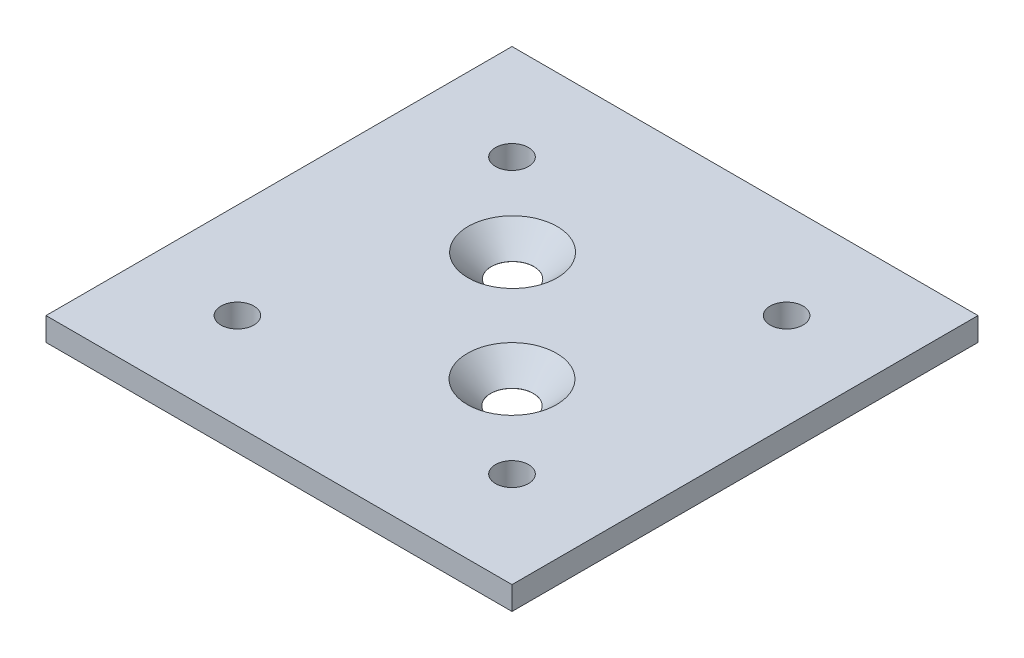
ISO-10303-21;
HEADER;
FILE_DESCRIPTION(('STEP AP214'),'2;1');
FILE_NAME('part.step','',(''),(''),'','','');
FILE_SCHEMA(('AUTOMOTIVE_DESIGN { 1 0 10303 214 1 1 1 1 }'));
ENDSEC;
DATA;
#1=APPLICATION_CONTEXT('core data for automotive mechanical design processes');
#2=APPLICATION_PROTOCOL_DEFINITION('international standard','automotive_design',2000,#1);
#3=PRODUCT_CONTEXT('',#1,'mechanical');
#4=PRODUCT('Part','Part','',(#3));
#5=PRODUCT_RELATED_PRODUCT_CATEGORY('part','',(#4));
#6=PRODUCT_DEFINITION_FORMATION('','',#4);
#7=PRODUCT_DEFINITION_CONTEXT('part definition',#1,'design');
#8=PRODUCT_DEFINITION('design','',#6,#7);
#9=PRODUCT_DEFINITION_SHAPE('','',#8);
#10=(LENGTH_UNIT() NAMED_UNIT(*) SI_UNIT(.MILLI.,.METRE.));
#11=(NAMED_UNIT(*) PLANE_ANGLE_UNIT() SI_UNIT($,.RADIAN.));
#12=(NAMED_UNIT(*) SI_UNIT($,.STERADIAN.) SOLID_ANGLE_UNIT());
#13=UNCERTAINTY_MEASURE_WITH_UNIT(LENGTH_MEASURE(1.E-05),#10,'distance_accuracy_value','');
#14=(GEOMETRIC_REPRESENTATION_CONTEXT(3) GLOBAL_UNCERTAINTY_ASSIGNED_CONTEXT((#13)) GLOBAL_UNIT_ASSIGNED_CONTEXT((#10,
#11,#12)) REPRESENTATION_CONTEXT('',''));
#15=CARTESIAN_POINT('',(0.,0.,0.));
#16=DIRECTION('',(0.,0.,1.));
#17=DIRECTION('',(1.,0.,0.));
#18=AXIS2_PLACEMENT_3D('',#15,#16,#17);
#19=CARTESIAN_POINT('',(0.,3.,0.));
#20=DIRECTION('',(0.,-1.,0.));
#21=DIRECTION('',(0.,0.,-1.));
#22=AXIS2_PLACEMENT_3D('',#19,#20,#21);
#23=PLANE('',#22);
#24=CARTESIAN_POINT('',(22.9663646158878,3.,-37.1083031226422));
#25=DIRECTION('',(0.,1.,0.));
#26=DIRECTION('',(0.,0.,1.));
#27=AXIS2_PLACEMENT_3D('',#24,#25,#26);
#28=CIRCLE('',#27,5.735);
#29=CARTESIAN_POINT('',(22.9663646158878,3.,-31.3733031226422));
#30=VERTEX_POINT('',#29);
#31=EDGE_CURVE('E152',#30,#30,#28,.T.);
#32=ORIENTED_EDGE('',*,*,#31,.F.);
#33=EDGE_LOOP('',(#32));
#34=FACE_BOUND('',#33,.T.);
#35=CARTESIAN_POINT('',(37.0710678118655,3.,-22.9289321881345));
#36=DIRECTION('',(0.,1.,0.));
#37=DIRECTION('',(0.,0.,1.));
#38=AXIS2_PLACEMENT_3D('',#35,#36,#37);
#39=CIRCLE('',#38,5.735);
#40=CARTESIAN_POINT('',(37.0710678118655,3.,-17.1939321881345));
#41=VERTEX_POINT('',#40);
#42=EDGE_CURVE('E143',#41,#41,#39,.T.);
#43=ORIENTED_EDGE('',*,*,#42,.F.);
#44=EDGE_LOOP('',(#43));
#45=FACE_BOUND('',#44,.T.);
#46=CARTESIAN_POINT('',(47.6776695296637,3.,-12.3223304703363));
#47=DIRECTION('',(0.,1.,0.));
#48=DIRECTION('',(0.,0.,1.));
#49=AXIS2_PLACEMENT_3D('',#46,#47,#48);
#50=CIRCLE('',#49,2.125);
#51=CARTESIAN_POINT('',(47.6776695296637,3.,-10.1973304703363));
#52=VERTEX_POINT('',#51);
#53=EDGE_CURVE('E123',#52,#52,#50,.T.);
#54=ORIENTED_EDGE('',*,*,#53,.F.);
#55=EDGE_LOOP('',(#54));
#56=FACE_BOUND('',#55,.T.);
#57=CARTESIAN_POINT('',(12.3223304703363,3.,-47.6776695296637));
#58=DIRECTION('',(0.,1.,0.));
#59=DIRECTION('',(0.,0.,1.));
#60=AXIS2_PLACEMENT_3D('',#57,#58,#59);
#61=CIRCLE('',#60,2.125);
#62=CARTESIAN_POINT('',(12.3223304703363,3.,-45.5526695296637));
#63=VERTEX_POINT('',#62);
#64=EDGE_CURVE('E102',#63,#63,#61,.T.);
#65=ORIENTED_EDGE('',*,*,#64,.F.);
#66=EDGE_LOOP('',(#65));
#67=FACE_BOUND('',#66,.T.);
#68=DIRECTION('',(0.,0.,1.));
#69=VECTOR('',#68,1.);
#70=CARTESIAN_POINT('',(0.,3.,0.));
#71=LINE('',#70,#69);
#72=CARTESIAN_POINT('',(0.,3.,-60.));
#73=VERTEX_POINT('',#72);
#74=CARTESIAN_POINT('',(0.,3.,0.));
#75=VERTEX_POINT('',#74);
#76=EDGE_CURVE('E87',#73,#75,#71,.T.);
#77=ORIENTED_EDGE('',*,*,#76,.T.);
#78=DIRECTION('',(1.,0.,0.));
#79=VECTOR('',#78,1.);
#80=CARTESIAN_POINT('',(0.,3.,0.));
#81=LINE('',#80,#79);
#82=CARTESIAN_POINT('',(60.,3.,0.));
#83=VERTEX_POINT('',#82);
#84=EDGE_CURVE('E82',#75,#83,#81,.T.);
#85=ORIENTED_EDGE('',*,*,#84,.T.);
#86=DIRECTION('',(0.,0.,-1.));
#87=VECTOR('',#86,1.);
#88=CARTESIAN_POINT('',(60.,3.,0.));
#89=LINE('',#88,#87);
#90=CARTESIAN_POINT('',(60.,3.,-60.));
#91=VERTEX_POINT('',#90);
#92=EDGE_CURVE('E85',#83,#91,#89,.T.);
#93=ORIENTED_EDGE('',*,*,#92,.T.);
#94=DIRECTION('',(-1.,0.,0.));
#95=VECTOR('',#94,1.);
#96=CARTESIAN_POINT('',(0.,3.,-60.));
#97=LINE('',#96,#95);
#98=EDGE_CURVE('E52',#91,#73,#97,.T.);
#99=ORIENTED_EDGE('',*,*,#98,.T.);
#100=EDGE_LOOP('',(#77,#85,#93,#99));
#101=FACE_BOUND('',#100,.T.);
#102=CARTESIAN_POINT('',(12.3223304703363,3.,-12.3223304703363));
#103=DIRECTION('',(0.,1.,0.));
#104=DIRECTION('',(0.,0.,1.));
#105=AXIS2_PLACEMENT_3D('',#102,#103,#104);
#106=CIRCLE('',#105,2.125);
#107=CARTESIAN_POINT('',(12.3223304703363,3.,-10.1973304703363));
#108=VERTEX_POINT('',#107);
#109=EDGE_CURVE('E117',#108,#108,#106,.T.);
#110=ORIENTED_EDGE('',*,*,#109,.F.);
#111=EDGE_LOOP('',(#110));
#112=FACE_BOUND('',#111,.T.);
#113=CARTESIAN_POINT('',(47.6776695296637,3.,-47.6776695296637));
#114=DIRECTION('',(0.,1.,0.));
#115=DIRECTION('',(0.,0.,1.));
#116=AXIS2_PLACEMENT_3D('',#113,#114,#115);
#117=CIRCLE('',#116,2.125);
#118=CARTESIAN_POINT('',(47.6776695296637,3.,-45.5526695296637));
#119=VERTEX_POINT('',#118);
#120=EDGE_CURVE('E129',#119,#119,#117,.T.);
#121=ORIENTED_EDGE('',*,*,#120,.F.);
#122=EDGE_LOOP('',(#121));
#123=FACE_BOUND('',#122,.T.);
#124=ADVANCED_FACE('F35',(#34,#45,#56,#67,#101,#112,#123),#23,.F.);
#125=CARTESIAN_POINT('',(0.,0.,0.));
#126=DIRECTION('',(0.,-1.,0.));
#127=DIRECTION('',(0.,0.,-1.));
#128=AXIS2_PLACEMENT_3D('',#125,#126,#127);
#129=PLANE('',#128);
#130=CARTESIAN_POINT('',(22.9663646158878,0.,-37.1083031226422));
#131=DIRECTION('',(0.,1.,0.));
#132=DIRECTION('',(0.,0.,1.));
#133=AXIS2_PLACEMENT_3D('',#130,#131,#132);
#134=CIRCLE('',#133,2.75);
#135=CARTESIAN_POINT('',(22.9663646158878,0.,-34.3583031226422));
#136=VERTEX_POINT('',#135);
#137=EDGE_CURVE('E146',#136,#136,#134,.T.);
#138=ORIENTED_EDGE('',*,*,#137,.T.);
#139=EDGE_LOOP('',(#138));
#140=FACE_BOUND('',#139,.T.);
#141=CARTESIAN_POINT('',(37.0710678118655,0.,-22.9289321881345));
#142=DIRECTION('',(0.,1.,0.));
#143=DIRECTION('',(0.,0.,1.));
#144=AXIS2_PLACEMENT_3D('',#141,#142,#143);
#145=CIRCLE('',#144,2.75);
#146=CARTESIAN_POINT('',(37.0710678118655,0.,-20.1789321881345));
#147=VERTEX_POINT('',#146);
#148=EDGE_CURVE('E135',#147,#147,#145,.T.);
#149=ORIENTED_EDGE('',*,*,#148,.T.);
#150=EDGE_LOOP('',(#149));
#151=FACE_BOUND('',#150,.T.);
#152=CARTESIAN_POINT('',(47.6776695296637,0.,-12.3223304703363));
#153=DIRECTION('',(0.,1.,0.));
#154=DIRECTION('',(0.,0.,1.));
#155=AXIS2_PLACEMENT_3D('',#152,#153,#154);
#156=CIRCLE('',#155,2.125);
#157=CARTESIAN_POINT('',(47.6776695296637,0.,-10.1973304703363));
#158=VERTEX_POINT('',#157);
#159=EDGE_CURVE('E126',#158,#158,#156,.T.);
#160=ORIENTED_EDGE('',*,*,#159,.T.);
#161=EDGE_LOOP('',(#160));
#162=FACE_BOUND('',#161,.T.);
#163=CARTESIAN_POINT('',(12.3223304703363,0.,-47.6776695296637));
#164=DIRECTION('',(0.,1.,0.));
#165=DIRECTION('',(0.,0.,1.));
#166=AXIS2_PLACEMENT_3D('',#163,#164,#165);
#167=CIRCLE('',#166,2.125);
#168=CARTESIAN_POINT('',(12.3223304703363,0.,-45.5526695296637));
#169=VERTEX_POINT('',#168);
#170=EDGE_CURVE('E114',#169,#169,#167,.T.);
#171=ORIENTED_EDGE('',*,*,#170,.T.);
#172=EDGE_LOOP('',(#171));
#173=FACE_BOUND('',#172,.T.);
#174=DIRECTION('',(0.,0.,1.));
#175=VECTOR('',#174,1.);
#176=CARTESIAN_POINT('',(0.,0.,0.));
#177=LINE('',#176,#175);
#178=CARTESIAN_POINT('',(0.,0.,-60.));
#179=VERTEX_POINT('',#178);
#180=CARTESIAN_POINT('',(0.,0.,0.));
#181=VERTEX_POINT('',#180);
#182=EDGE_CURVE('E99',#179,#181,#177,.T.);
#183=ORIENTED_EDGE('',*,*,#182,.F.);
#184=DIRECTION('',(-1.,0.,0.));
#185=VECTOR('',#184,1.);
#186=CARTESIAN_POINT('',(0.,0.,-60.));
#187=LINE('',#186,#185);
#188=CARTESIAN_POINT('',(60.,0.,-60.));
#189=VERTEX_POINT('',#188);
#190=EDGE_CURVE('E75',#189,#179,#187,.T.);
#191=ORIENTED_EDGE('',*,*,#190,.F.);
#192=DIRECTION('',(0.,0.,-1.));
#193=VECTOR('',#192,1.);
#194=CARTESIAN_POINT('',(60.,0.,0.));
#195=LINE('',#194,#193);
#196=CARTESIAN_POINT('',(60.,0.,0.));
#197=VERTEX_POINT('',#196);
#198=EDGE_CURVE('E69',#197,#189,#195,.T.);
#199=ORIENTED_EDGE('',*,*,#198,.F.);
#200=DIRECTION('',(1.,0.,0.));
#201=VECTOR('',#200,1.);
#202=CARTESIAN_POINT('',(0.,0.,0.));
#203=LINE('',#202,#201);
#204=EDGE_CURVE('E91',#181,#197,#203,.T.);
#205=ORIENTED_EDGE('',*,*,#204,.F.);
#206=EDGE_LOOP('',(#183,#191,#199,#205));
#207=FACE_BOUND('',#206,.T.);
#208=CARTESIAN_POINT('',(12.3223304703363,0.,-12.3223304703363));
#209=DIRECTION('',(0.,1.,0.));
#210=DIRECTION('',(0.,0.,1.));
#211=AXIS2_PLACEMENT_3D('',#208,#209,#210);
#212=CIRCLE('',#211,2.125);
#213=CARTESIAN_POINT('',(12.3223304703363,0.,-10.1973304703363));
#214=VERTEX_POINT('',#213);
#215=EDGE_CURVE('E120',#214,#214,#212,.T.);
#216=ORIENTED_EDGE('',*,*,#215,.T.);
#217=EDGE_LOOP('',(#216));
#218=FACE_BOUND('',#217,.T.);
#219=CARTESIAN_POINT('',(47.6776695296637,0.,-47.6776695296637));
#220=DIRECTION('',(0.,1.,0.));
#221=DIRECTION('',(0.,0.,1.));
#222=AXIS2_PLACEMENT_3D('',#219,#220,#221);
#223=CIRCLE('',#222,2.125);
#224=CARTESIAN_POINT('',(47.6776695296637,0.,-45.5526695296637));
#225=VERTEX_POINT('',#224);
#226=EDGE_CURVE('E132',#225,#225,#223,.T.);
#227=ORIENTED_EDGE('',*,*,#226,.T.);
#228=EDGE_LOOP('',(#227));
#229=FACE_BOUND('',#228,.T.);
#230=ADVANCED_FACE('F110',(#140,#151,#162,#173,#207,#218,#229),#129,.T.);
#231=CARTESIAN_POINT('',(0.,3.,0.));
#232=DIRECTION('',(1.,0.,0.));
#233=DIRECTION('',(0.,0.,-1.));
#234=AXIS2_PLACEMENT_3D('',#231,#232,#233);
#235=PLANE('',#234);
#236=ORIENTED_EDGE('',*,*,#182,.T.);
#237=DIRECTION('',(0.,-1.,0.));
#238=VECTOR('',#237,1.);
#239=CARTESIAN_POINT('',(0.,3.,0.));
#240=LINE('',#239,#238);
#241=EDGE_CURVE('E11',#75,#181,#240,.T.);
#242=ORIENTED_EDGE('',*,*,#241,.F.);
#243=ORIENTED_EDGE('',*,*,#76,.F.);
#244=DIRECTION('',(0.,-1.,0.));
#245=VECTOR('',#244,1.);
#246=CARTESIAN_POINT('',(0.,3.,-60.));
#247=LINE('',#246,#245);
#248=EDGE_CURVE('E95',#73,#179,#247,.T.);
#249=ORIENTED_EDGE('',*,*,#248,.T.);
#250=EDGE_LOOP('',(#236,#242,#243,#249));
#251=FACE_BOUND('',#250,.T.);
#252=ADVANCED_FACE('F37',(#251),#235,.F.);
#253=CARTESIAN_POINT('',(0.,3.,0.));
#254=DIRECTION('',(0.,0.,-1.));
#255=DIRECTION('',(-1.,0.,0.));
#256=AXIS2_PLACEMENT_3D('',#253,#254,#255);
#257=PLANE('',#256);
#258=ORIENTED_EDGE('',*,*,#204,.T.);
#259=DIRECTION('',(0.,-1.,0.));
#260=VECTOR('',#259,1.);
#261=CARTESIAN_POINT('',(60.,3.,0.));
#262=LINE('',#261,#260);
#263=EDGE_CURVE('E44',#83,#197,#262,.T.);
#264=ORIENTED_EDGE('',*,*,#263,.F.);
#265=ORIENTED_EDGE('',*,*,#84,.F.);
#266=ORIENTED_EDGE('',*,*,#241,.T.);
#267=EDGE_LOOP('',(#258,#264,#265,#266));
#268=FACE_BOUND('',#267,.T.);
#269=ADVANCED_FACE('F90',(#268),#257,.F.);
#270=CARTESIAN_POINT('',(60.,3.,0.));
#271=DIRECTION('',(-1.,0.,0.));
#272=DIRECTION('',(0.,0.,1.));
#273=AXIS2_PLACEMENT_3D('',#270,#271,#272);
#274=PLANE('',#273);
#275=ORIENTED_EDGE('',*,*,#198,.T.);
#276=DIRECTION('',(0.,-1.,0.));
#277=VECTOR('',#276,1.);
#278=CARTESIAN_POINT('',(60.,3.,-60.));
#279=LINE('',#278,#277);
#280=EDGE_CURVE('E92',#91,#189,#279,.T.);
#281=ORIENTED_EDGE('',*,*,#280,.F.);
#282=ORIENTED_EDGE('',*,*,#92,.F.);
#283=ORIENTED_EDGE('',*,*,#263,.T.);
#284=EDGE_LOOP('',(#275,#281,#282,#283));
#285=FACE_BOUND('',#284,.T.);
#286=ADVANCED_FACE('F93',(#285),#274,.F.);
#287=CARTESIAN_POINT('',(0.,3.,-60.));
#288=DIRECTION('',(0.,0.,1.));
#289=DIRECTION('',(1.,0.,0.));
#290=AXIS2_PLACEMENT_3D('',#287,#288,#289);
#291=PLANE('',#290);
#292=ORIENTED_EDGE('',*,*,#190,.T.);
#293=ORIENTED_EDGE('',*,*,#248,.F.);
#294=ORIENTED_EDGE('',*,*,#98,.F.);
#295=ORIENTED_EDGE('',*,*,#280,.T.);
#296=EDGE_LOOP('',(#292,#293,#294,#295));
#297=FACE_BOUND('',#296,.T.);
#298=ADVANCED_FACE('F107',(#297),#291,.F.);
#299=CARTESIAN_POINT('',(12.3223304703363,3.,-47.6776695296637));
#300=DIRECTION('',(0.,-1.,0.));
#301=DIRECTION('',(0.,0.,-1.));
#302=AXIS2_PLACEMENT_3D('',#299,#300,#301);
#303=CYLINDRICAL_SURFACE('',#302,2.125);
#304=ORIENTED_EDGE('',*,*,#64,.T.);
#305=EDGE_LOOP('',(#304));
#306=FACE_BOUND('',#305,.T.);
#307=ORIENTED_EDGE('',*,*,#170,.F.);
#308=EDGE_LOOP('',(#307));
#309=FACE_BOUND('',#308,.T.);
#310=ADVANCED_FACE('F167',(#306,#309),#303,.F.);
#311=CARTESIAN_POINT('',(12.3223304703363,3.,-12.3223304703363));
#312=DIRECTION('',(0.,-1.,0.));
#313=DIRECTION('',(0.,0.,-1.));
#314=AXIS2_PLACEMENT_3D('',#311,#312,#313);
#315=CYLINDRICAL_SURFACE('',#314,2.125);
#316=ORIENTED_EDGE('',*,*,#109,.T.);
#317=EDGE_LOOP('',(#316));
#318=FACE_BOUND('',#317,.T.);
#319=ORIENTED_EDGE('',*,*,#215,.F.);
#320=EDGE_LOOP('',(#319));
#321=FACE_BOUND('',#320,.T.);
#322=ADVANCED_FACE('F170',(#318,#321),#315,.F.);
#323=CARTESIAN_POINT('',(47.6776695296637,3.,-12.3223304703363));
#324=DIRECTION('',(0.,-1.,0.));
#325=DIRECTION('',(0.,0.,-1.));
#326=AXIS2_PLACEMENT_3D('',#323,#324,#325);
#327=CYLINDRICAL_SURFACE('',#326,2.125);
#328=ORIENTED_EDGE('',*,*,#53,.T.);
#329=EDGE_LOOP('',(#328));
#330=FACE_BOUND('',#329,.T.);
#331=ORIENTED_EDGE('',*,*,#159,.F.);
#332=EDGE_LOOP('',(#331));
#333=FACE_BOUND('',#332,.T.);
#334=ADVANCED_FACE('F208',(#330,#333),#327,.F.);
#335=CARTESIAN_POINT('',(47.6776695296637,3.,-47.6776695296637));
#336=DIRECTION('',(0.,-1.,0.));
#337=DIRECTION('',(0.,0.,-1.));
#338=AXIS2_PLACEMENT_3D('',#335,#336,#337);
#339=CYLINDRICAL_SURFACE('',#338,2.125);
#340=ORIENTED_EDGE('',*,*,#120,.T.);
#341=EDGE_LOOP('',(#340));
#342=FACE_BOUND('',#341,.T.);
#343=ORIENTED_EDGE('',*,*,#226,.F.);
#344=EDGE_LOOP('',(#343));
#345=FACE_BOUND('',#344,.T.);
#346=ADVANCED_FACE('F216',(#342,#345),#339,.F.);
#347=CARTESIAN_POINT('',(37.0710678118655,3.,-22.9289321881345));
#348=DIRECTION('',(0.,1.,0.));
#349=DIRECTION('',(0.,0.,1.));
#350=AXIS2_PLACEMENT_3D('',#347,#348,#349);
#351=CYLINDRICAL_SURFACE('',#350,2.75);
#352=ORIENTED_EDGE('',*,*,#148,.F.);
#353=EDGE_LOOP('',(#352));
#354=FACE_BOUND('',#353,.T.);
#355=CARTESIAN_POINT('',(37.0710678118655,0.0149999999999985,-22.9289321881345));
#356=DIRECTION('',(0.,1.,0.));
#357=DIRECTION('',(0.,0.,1.));
#358=AXIS2_PLACEMENT_3D('',#355,#356,#357);
#359=CIRCLE('',#358,2.74999999999999);
#360=CARTESIAN_POINT('',(37.0710678118655,0.0149999999999985,-20.1789321881345));
#361=VERTEX_POINT('',#360);
#362=EDGE_CURVE('E140',#361,#361,#359,.T.);
#363=ORIENTED_EDGE('',*,*,#362,.T.);
#364=EDGE_LOOP('',(#363));
#365=FACE_BOUND('',#364,.T.);
#366=ADVANCED_FACE('F224',(#354,#365),#351,.F.);
#367=CARTESIAN_POINT('',(37.0710678118655,3.,-22.9289321881345));
#368=DIRECTION('',(0.,1.,0.));
#369=DIRECTION('',(0.,0.,1.));
#370=AXIS2_PLACEMENT_3D('',#367,#368,#369);
#371=CONICAL_SURFACE('',#370,5.735,0.785398163397449);
#372=ORIENTED_EDGE('',*,*,#362,.F.);
#373=EDGE_LOOP('',(#372));
#374=FACE_BOUND('',#373,.T.);
#375=ORIENTED_EDGE('',*,*,#42,.T.);
#376=EDGE_LOOP('',(#375));
#377=FACE_BOUND('',#376,.T.);
#378=ADVANCED_FACE('F233',(#374,#377),#371,.F.);
#379=CARTESIAN_POINT('',(22.9663646158878,3.,-37.1083031226422));
#380=DIRECTION('',(0.,1.,0.));
#381=DIRECTION('',(0.,0.,1.));
#382=AXIS2_PLACEMENT_3D('',#379,#380,#381);
#383=CYLINDRICAL_SURFACE('',#382,2.74999999999999);
#384=ORIENTED_EDGE('',*,*,#137,.F.);
#385=EDGE_LOOP('',(#384));
#386=FACE_BOUND('',#385,.T.);
#387=CARTESIAN_POINT('',(22.9663646158878,0.0149999999999985,-37.1083031226422));
#388=DIRECTION('',(0.,1.,0.));
#389=DIRECTION('',(0.,0.,1.));
#390=AXIS2_PLACEMENT_3D('',#387,#388,#389);
#391=CIRCLE('',#390,2.74999999999999);
#392=CARTESIAN_POINT('',(22.9663646158878,0.0149999999999985,-34.3583031226422));
#393=VERTEX_POINT('',#392);
#394=EDGE_CURVE('E149',#393,#393,#391,.T.);
#395=ORIENTED_EDGE('',*,*,#394,.T.);
#396=EDGE_LOOP('',(#395));
#397=FACE_BOUND('',#396,.T.);
#398=ADVANCED_FACE('F241',(#386,#397),#383,.F.);
#399=CARTESIAN_POINT('',(22.9663646158878,3.,-37.1083031226422));
#400=DIRECTION('',(0.,1.,0.));
#401=DIRECTION('',(0.,0.,1.));
#402=AXIS2_PLACEMENT_3D('',#399,#400,#401);
#403=CONICAL_SURFACE('',#402,5.735,0.78539816339745);
#404=ORIENTED_EDGE('',*,*,#394,.F.);
#405=EDGE_LOOP('',(#404));
#406=FACE_BOUND('',#405,.T.);
#407=ORIENTED_EDGE('',*,*,#31,.T.);
#408=EDGE_LOOP('',(#407));
#409=FACE_BOUND('',#408,.T.);
#410=ADVANCED_FACE('F156',(#406,#409),#403,.F.);
#411=CLOSED_SHELL('',(#124,#230,#252,#269,#286,#298,#310,#322,#334,#346,#366,#378,#398,#410));
#412=MANIFOLD_SOLID_BREP('B2',#411);
#413=ADVANCED_BREP_SHAPE_REPRESENTATION('',(#18,#412),#14);
#414=SHAPE_DEFINITION_REPRESENTATION(#9,#413);
ENDSEC;
END-ISO-10303-21;
